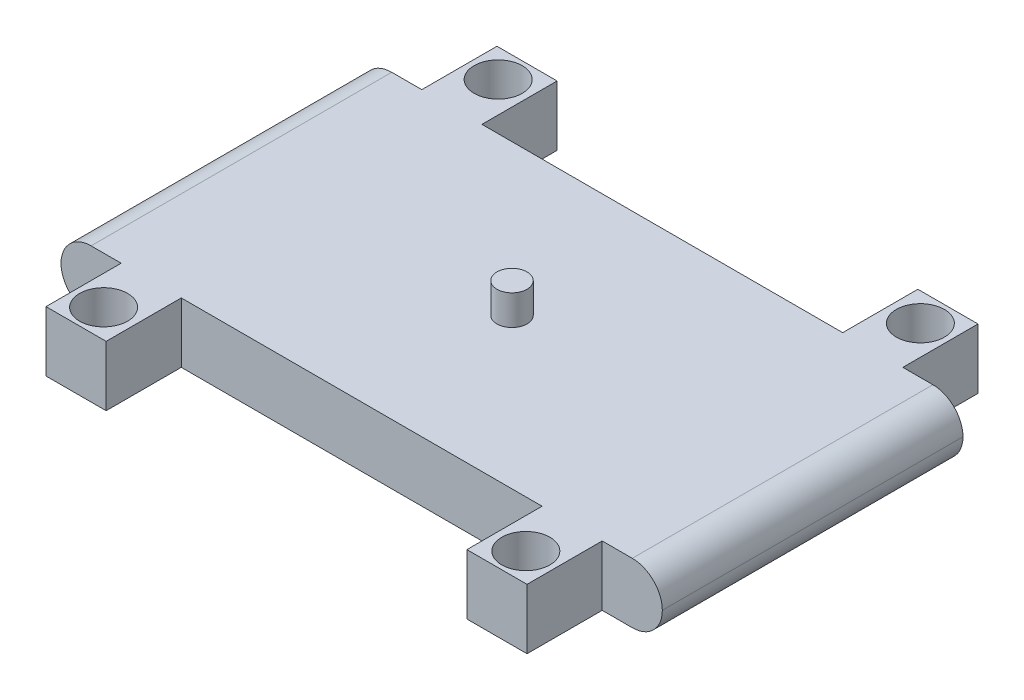
ISO-10303-21;
HEADER;
FILE_DESCRIPTION(('STEP AP214'),'2;1');
FILE_NAME('part.step','',(''),(''),'','','');
FILE_SCHEMA(('AUTOMOTIVE_DESIGN { 1 0 10303 214 1 1 1 1 }'));
ENDSEC;
DATA;
#1=APPLICATION_CONTEXT('core data for automotive mechanical design processes');
#2=APPLICATION_PROTOCOL_DEFINITION('international standard','automotive_design',2000,#1);
#3=PRODUCT_CONTEXT('',#1,'mechanical');
#4=PRODUCT('Part','Part','',(#3));
#5=PRODUCT_RELATED_PRODUCT_CATEGORY('part','',(#4));
#6=PRODUCT_DEFINITION_FORMATION('','',#4);
#7=PRODUCT_DEFINITION_CONTEXT('part definition',#1,'design');
#8=PRODUCT_DEFINITION('design','',#6,#7);
#9=PRODUCT_DEFINITION_SHAPE('','',#8);
#10=(LENGTH_UNIT() NAMED_UNIT(*) SI_UNIT(.MILLI.,.METRE.));
#11=(NAMED_UNIT(*) PLANE_ANGLE_UNIT() SI_UNIT($,.RADIAN.));
#12=(NAMED_UNIT(*) SI_UNIT($,.STERADIAN.) SOLID_ANGLE_UNIT());
#13=UNCERTAINTY_MEASURE_WITH_UNIT(LENGTH_MEASURE(1.E-05),#10,'distance_accuracy_value','');
#14=(GEOMETRIC_REPRESENTATION_CONTEXT(3) GLOBAL_UNCERTAINTY_ASSIGNED_CONTEXT((#13)) GLOBAL_UNIT_ASSIGNED_CONTEXT((#10,
#11,#12)) REPRESENTATION_CONTEXT('',''));
#15=CARTESIAN_POINT('',(0.,0.,0.));
#16=DIRECTION('',(0.,0.,1.));
#17=DIRECTION('',(1.,0.,0.));
#18=AXIS2_PLACEMENT_3D('',#15,#16,#17);
#19=CARTESIAN_POINT('',(100.,20.,50.));
#20=DIRECTION('',(0.,0.,-1.));
#21=DIRECTION('',(-1.,0.,0.));
#22=AXIS2_PLACEMENT_3D('',#19,#20,#21);
#23=PLANE('',#22);
#24=DIRECTION('',(1.,0.,0.));
#25=VECTOR('',#24,1.);
#26=CARTESIAN_POINT('',(100.,0.,50.));
#27=LINE('',#26,#25);
#28=CARTESIAN_POINT('',(80.,0.,50.));
#29=VERTEX_POINT('',#28);
#30=CARTESIAN_POINT('',(90.,0.,50.));
#31=VERTEX_POINT('',#30);
#32=EDGE_CURVE('E305',#29,#31,#27,.T.);
#33=ORIENTED_EDGE('',*,*,#32,.T.);
#34=CARTESIAN_POINT('',(90.,10.,50.));
#35=DIRECTION('',(0.,0.,-1.));
#36=DIRECTION('',(-1.,0.,0.));
#37=AXIS2_PLACEMENT_3D('',#34,#35,#36);
#38=CIRCLE('',#37,10.);
#39=CARTESIAN_POINT('',(100.,10.,50.));
#40=VERTEX_POINT('',#39);
#41=EDGE_CURVE('E338',#31,#40,#38,.F.);
#42=ORIENTED_EDGE('',*,*,#41,.T.);
#43=CARTESIAN_POINT('',(90.,10.,50.));
#44=DIRECTION('',(0.,0.,-1.));
#45=DIRECTION('',(-1.,0.,0.));
#46=AXIS2_PLACEMENT_3D('',#43,#44,#45);
#47=CIRCLE('',#46,10.);
#48=CARTESIAN_POINT('',(90.,20.,50.));
#49=VERTEX_POINT('',#48);
#50=EDGE_CURVE('E335',#40,#49,#47,.F.);
#51=ORIENTED_EDGE('',*,*,#50,.T.);
#52=DIRECTION('',(1.,0.,0.));
#53=VECTOR('',#52,1.);
#54=CARTESIAN_POINT('',(100.,20.,50.));
#55=LINE('',#54,#53);
#56=CARTESIAN_POINT('',(80.,20.,50.));
#57=VERTEX_POINT('',#56);
#58=EDGE_CURVE('E311',#57,#49,#55,.T.);
#59=ORIENTED_EDGE('',*,*,#58,.F.);
#60=DIRECTION('',(0.,1.,0.));
#61=VECTOR('',#60,1.);
#62=CARTESIAN_POINT('',(80.,20.,50.));
#63=LINE('',#62,#61);
#64=EDGE_CURVE('E218',#29,#57,#63,.T.);
#65=ORIENTED_EDGE('',*,*,#64,.F.);
#66=EDGE_LOOP('',(#33,#42,#51,#59,#65));
#67=FACE_BOUND('',#66,.T.);
#68=ADVANCED_FACE('F43',(#67),#23,.F.);
#69=DIRECTION('',(0.,-1.,0.));
#70=VECTOR('',#69,1.);
#71=CARTESIAN_POINT('',(60.,20.,50.));
#72=LINE('',#71,#70);
#73=CARTESIAN_POINT('',(60.,20.,50.));
#74=VERTEX_POINT('',#73);
#75=CARTESIAN_POINT('',(60.,0.,50.));
#76=VERTEX_POINT('',#75);
#77=EDGE_CURVE('E226',#74,#76,#72,.T.);
#78=ORIENTED_EDGE('',*,*,#77,.F.);
#79=CARTESIAN_POINT('',(-60.,20.,50.));
#80=VERTEX_POINT('',#79);
#81=EDGE_CURVE('E310',#80,#74,#55,.T.);
#82=ORIENTED_EDGE('',*,*,#81,.F.);
#83=DIRECTION('',(0.,1.,0.));
#84=VECTOR('',#83,1.);
#85=CARTESIAN_POINT('',(-60.,20.,50.));
#86=LINE('',#85,#84);
#87=CARTESIAN_POINT('',(-60.,0.,50.));
#88=VERTEX_POINT('',#87);
#89=EDGE_CURVE('E293',#88,#80,#86,.T.);
#90=ORIENTED_EDGE('',*,*,#89,.F.);
#91=EDGE_CURVE('E321',#88,#76,#27,.T.);
#92=ORIENTED_EDGE('',*,*,#91,.T.);
#93=EDGE_LOOP('',(#78,#82,#90,#92));
#94=FACE_BOUND('',#93,.T.);
#95=ADVANCED_FACE('F513',(#94),#23,.F.);
#96=CARTESIAN_POINT('',(100.,20.,-50.));
#97=DIRECTION('',(0.,0.,1.));
#98=DIRECTION('',(1.,0.,0.));
#99=AXIS2_PLACEMENT_3D('',#96,#97,#98);
#100=PLANE('',#99);
#101=CARTESIAN_POINT('',(90.,10.,-50.));
#102=DIRECTION('',(0.,0.,1.));
#103=DIRECTION('',(1.,0.,0.));
#104=AXIS2_PLACEMENT_3D('',#101,#102,#103);
#105=CIRCLE('',#104,10.);
#106=CARTESIAN_POINT('',(90.,20.,-50.));
#107=VERTEX_POINT('',#106);
#108=CARTESIAN_POINT('',(100.,10.,-50.));
#109=VERTEX_POINT('',#108);
#110=EDGE_CURVE('E315',#107,#109,#105,.F.);
#111=ORIENTED_EDGE('',*,*,#110,.T.);
#112=CARTESIAN_POINT('',(90.,10.,-50.));
#113=DIRECTION('',(0.,0.,1.));
#114=DIRECTION('',(1.,0.,0.));
#115=AXIS2_PLACEMENT_3D('',#112,#113,#114);
#116=CIRCLE('',#115,10.);
#117=CARTESIAN_POINT('',(90.,0.,-50.));
#118=VERTEX_POINT('',#117);
#119=EDGE_CURVE('E328',#109,#118,#116,.F.);
#120=ORIENTED_EDGE('',*,*,#119,.T.);
#121=DIRECTION('',(-1.,0.,0.));
#122=VECTOR('',#121,1.);
#123=CARTESIAN_POINT('',(100.,0.,-50.));
#124=LINE('',#123,#122);
#125=CARTESIAN_POINT('',(80.,0.,-50.));
#126=VERTEX_POINT('',#125);
#127=EDGE_CURVE('E322',#118,#126,#124,.T.);
#128=ORIENTED_EDGE('',*,*,#127,.T.);
#129=DIRECTION('',(0.,-1.,0.));
#130=VECTOR('',#129,1.);
#131=CARTESIAN_POINT('',(80.,20.,-50.));
#132=LINE('',#131,#130);
#133=CARTESIAN_POINT('',(80.,20.,-50.));
#134=VERTEX_POINT('',#133);
#135=EDGE_CURVE('E234',#134,#126,#132,.T.);
#136=ORIENTED_EDGE('',*,*,#135,.F.);
#137=DIRECTION('',(-1.,0.,0.));
#138=VECTOR('',#137,1.);
#139=CARTESIAN_POINT('',(100.,20.,-50.));
#140=LINE('',#139,#138);
#141=EDGE_CURVE('E312',#107,#134,#140,.T.);
#142=ORIENTED_EDGE('',*,*,#141,.F.);
#143=EDGE_LOOP('',(#111,#120,#128,#136,#142));
#144=FACE_BOUND('',#143,.T.);
#145=ADVANCED_FACE('F519',(#144),#100,.F.);
#146=DIRECTION('',(0.,1.,0.));
#147=VECTOR('',#146,1.);
#148=CARTESIAN_POINT('',(60.,20.,-50.));
#149=LINE('',#148,#147);
#150=CARTESIAN_POINT('',(60.,0.,-50.));
#151=VERTEX_POINT('',#150);
#152=CARTESIAN_POINT('',(60.,20.,-50.));
#153=VERTEX_POINT('',#152);
#154=EDGE_CURVE('E220',#151,#153,#149,.T.);
#155=ORIENTED_EDGE('',*,*,#154,.F.);
#156=CARTESIAN_POINT('',(-60.,0.,-50.));
#157=VERTEX_POINT('',#156);
#158=EDGE_CURVE('E325',#151,#157,#124,.T.);
#159=ORIENTED_EDGE('',*,*,#158,.T.);
#160=DIRECTION('',(0.,-1.,0.));
#161=VECTOR('',#160,1.);
#162=CARTESIAN_POINT('',(-60.,20.,-50.));
#163=LINE('',#162,#161);
#164=CARTESIAN_POINT('',(-60.,20.,-50.));
#165=VERTEX_POINT('',#164);
#166=EDGE_CURVE('E289',#165,#157,#163,.T.);
#167=ORIENTED_EDGE('',*,*,#166,.F.);
#168=EDGE_CURVE('E316',#153,#165,#140,.T.);
#169=ORIENTED_EDGE('',*,*,#168,.F.);
#170=EDGE_LOOP('',(#155,#159,#167,#169));
#171=FACE_BOUND('',#170,.T.);
#172=ADVANCED_FACE('F524',(#171),#100,.F.);
#173=CARTESIAN_POINT('',(-90.,10.,50.));
#174=DIRECTION('',(0.,0.,-1.));
#175=DIRECTION('',(-1.,0.,0.));
#176=AXIS2_PLACEMENT_3D('',#173,#174,#175);
#177=CIRCLE('',#176,10.);
#178=CARTESIAN_POINT('',(-90.,20.,50.));
#179=VERTEX_POINT('',#178);
#180=CARTESIAN_POINT('',(-100.,10.,50.));
#181=VERTEX_POINT('',#180);
#182=EDGE_CURVE('E344',#179,#181,#177,.F.);
#183=ORIENTED_EDGE('',*,*,#182,.T.);
#184=CARTESIAN_POINT('',(-90.,10.,50.));
#185=DIRECTION('',(0.,0.,-1.));
#186=DIRECTION('',(-1.,0.,0.));
#187=AXIS2_PLACEMENT_3D('',#184,#185,#186);
#188=CIRCLE('',#187,10.);
#189=CARTESIAN_POINT('',(-90.,0.,50.));
#190=VERTEX_POINT('',#189);
#191=EDGE_CURVE('E352',#181,#190,#188,.F.);
#192=ORIENTED_EDGE('',*,*,#191,.T.);
#193=CARTESIAN_POINT('',(-80.,0.,50.));
#194=VERTEX_POINT('',#193);
#195=EDGE_CURVE('E317',#190,#194,#27,.T.);
#196=ORIENTED_EDGE('',*,*,#195,.T.);
#197=DIRECTION('',(0.,-1.,0.));
#198=VECTOR('',#197,1.);
#199=CARTESIAN_POINT('',(-80.,20.,50.));
#200=LINE('',#199,#198);
#201=CARTESIAN_POINT('',(-80.,20.,50.));
#202=VERTEX_POINT('',#201);
#203=EDGE_CURVE('E301',#202,#194,#200,.T.);
#204=ORIENTED_EDGE('',*,*,#203,.F.);
#205=EDGE_CURVE('E306',#179,#202,#55,.T.);
#206=ORIENTED_EDGE('',*,*,#205,.F.);
#207=EDGE_LOOP('',(#183,#192,#196,#204,#206));
#208=FACE_BOUND('',#207,.T.);
#209=ADVANCED_FACE('F399',(#208),#23,.F.);
#210=CARTESIAN_POINT('',(-80.,0.,-50.));
#211=VERTEX_POINT('',#210);
#212=CARTESIAN_POINT('',(-90.,0.,-50.));
#213=VERTEX_POINT('',#212);
#214=EDGE_CURVE('E320',#211,#213,#124,.T.);
#215=ORIENTED_EDGE('',*,*,#214,.T.);
#216=CARTESIAN_POINT('',(-90.,10.,-50.));
#217=DIRECTION('',(0.,0.,1.));
#218=DIRECTION('',(1.,0.,0.));
#219=AXIS2_PLACEMENT_3D('',#216,#217,#218);
#220=CIRCLE('',#219,10.);
#221=CARTESIAN_POINT('',(-100.,10.,-50.));
#222=VERTEX_POINT('',#221);
#223=EDGE_CURVE('E53',#213,#222,#220,.F.);
#224=ORIENTED_EDGE('',*,*,#223,.T.);
#225=CARTESIAN_POINT('',(-90.,10.,-50.));
#226=DIRECTION('',(0.,0.,1.));
#227=DIRECTION('',(1.,0.,0.));
#228=AXIS2_PLACEMENT_3D('',#225,#226,#227);
#229=CIRCLE('',#228,10.);
#230=CARTESIAN_POINT('',(-90.,20.,-50.));
#231=VERTEX_POINT('',#230);
#232=EDGE_CURVE('E60',#222,#231,#229,.F.);
#233=ORIENTED_EDGE('',*,*,#232,.T.);
#234=CARTESIAN_POINT('',(-80.,20.,-50.));
#235=VERTEX_POINT('',#234);
#236=EDGE_CURVE('E309',#235,#231,#140,.T.);
#237=ORIENTED_EDGE('',*,*,#236,.F.);
#238=DIRECTION('',(0.,1.,0.));
#239=VECTOR('',#238,1.);
#240=CARTESIAN_POINT('',(-80.,20.,-50.));
#241=LINE('',#240,#239);
#242=EDGE_CURVE('E297',#211,#235,#241,.T.);
#243=ORIENTED_EDGE('',*,*,#242,.F.);
#244=EDGE_LOOP('',(#215,#224,#233,#237,#243));
#245=FACE_BOUND('',#244,.T.);
#246=ADVANCED_FACE('F523',(#245),#100,.F.);
#247=CARTESIAN_POINT('',(0.,20.,0.));
#248=DIRECTION('',(0.,1.,0.));
#249=DIRECTION('',(0.,0.,1.));
#250=AXIS2_PLACEMENT_3D('',#247,#248,#249);
#251=PLANE('',#250);
#252=CARTESIAN_POINT('',(0.,20.,0.));
#253=DIRECTION('',(0.,1.,0.));
#254=DIRECTION('',(0.,0.,1.));
#255=AXIS2_PLACEMENT_3D('',#252,#253,#254);
#256=CIRCLE('',#255,5.);
#257=CARTESIAN_POINT('',(0.,20.,5.));
#258=VERTEX_POINT('',#257);
#259=EDGE_CURVE('E486',#258,#258,#256,.F.);
#260=ORIENTED_EDGE('',*,*,#259,.T.);
#261=EDGE_LOOP('',(#260));
#262=FACE_BOUND('',#261,.T.);
#263=CARTESIAN_POINT('',(70.2217273274367,20.,-65.6166647925016));
#264=DIRECTION('',(0.,1.,0.));
#265=DIRECTION('',(0.,0.,1.));
#266=AXIS2_PLACEMENT_3D('',#263,#264,#265);
#267=CIRCLE('',#266,8.00000000000001);
#268=CARTESIAN_POINT('',(70.2217273274367,20.,-57.6166647925016));
#269=VERTEX_POINT('',#268);
#270=EDGE_CURVE('E450',#269,#269,#267,.F.);
#271=ORIENTED_EDGE('',*,*,#270,.T.);
#272=EDGE_LOOP('',(#271));
#273=FACE_BOUND('',#272,.T.);
#274=CARTESIAN_POINT('',(-70.2217273274367,20.,65.6166647925016));
#275=DIRECTION('',(0.,1.,0.));
#276=DIRECTION('',(0.,0.,1.));
#277=AXIS2_PLACEMENT_3D('',#274,#275,#276);
#278=CIRCLE('',#277,8.);
#279=CARTESIAN_POINT('',(-70.2217273274367,20.,73.6166647925016));
#280=VERTEX_POINT('',#279);
#281=EDGE_CURVE('E458',#280,#280,#278,.F.);
#282=ORIENTED_EDGE('',*,*,#281,.T.);
#283=EDGE_LOOP('',(#282));
#284=FACE_BOUND('',#283,.T.);
#285=CARTESIAN_POINT('',(70.2217273274367,20.,65.6166647925016));
#286=DIRECTION('',(0.,1.,0.));
#287=DIRECTION('',(0.,0.,1.));
#288=AXIS2_PLACEMENT_3D('',#285,#286,#287);
#289=CIRCLE('',#288,8.00000000000001);
#290=CARTESIAN_POINT('',(70.2217273274367,20.,73.6166647925016));
#291=VERTEX_POINT('',#290);
#292=EDGE_CURVE('E462',#291,#291,#289,.F.);
#293=ORIENTED_EDGE('',*,*,#292,.T.);
#294=EDGE_LOOP('',(#293));
#295=FACE_BOUND('',#294,.T.);
#296=CARTESIAN_POINT('',(-70.2217273274367,20.,-65.6166647925016));
#297=DIRECTION('',(0.,1.,0.));
#298=DIRECTION('',(0.,0.,1.));
#299=AXIS2_PLACEMENT_3D('',#296,#297,#298);
#300=CIRCLE('',#299,8.);
#301=CARTESIAN_POINT('',(-70.2217273274367,20.,-57.6166647925016));
#302=VERTEX_POINT('',#301);
#303=EDGE_CURVE('E466',#302,#302,#300,.F.);
#304=ORIENTED_EDGE('',*,*,#303,.T.);
#305=EDGE_LOOP('',(#304));
#306=FACE_BOUND('',#305,.T.);
#307=ORIENTED_EDGE('',*,*,#236,.T.);
#308=DIRECTION('',(0.,0.,1.));
#309=VECTOR('',#308,1.);
#310=CARTESIAN_POINT('',(-90.,20.,50.));
#311=LINE('',#310,#309);
#312=EDGE_CURVE('E11',#231,#179,#311,.T.);
#313=ORIENTED_EDGE('',*,*,#312,.T.);
#314=ORIENTED_EDGE('',*,*,#205,.T.);
#315=DIRECTION('',(0.,0.,-1.));
#316=VECTOR('',#315,1.);
#317=CARTESIAN_POINT('',(-80.,20.,75.));
#318=LINE('',#317,#316);
#319=CARTESIAN_POINT('',(-80.,20.,75.));
#320=VERTEX_POINT('',#319);
#321=EDGE_CURVE('E285',#320,#202,#318,.T.);
#322=ORIENTED_EDGE('',*,*,#321,.F.);
#323=DIRECTION('',(-1.,0.,0.));
#324=VECTOR('',#323,1.);
#325=CARTESIAN_POINT('',(-60.,20.,75.));
#326=LINE('',#325,#324);
#327=CARTESIAN_POINT('',(-60.,20.,75.));
#328=VERTEX_POINT('',#327);
#329=EDGE_CURVE('E241',#328,#320,#326,.T.);
#330=ORIENTED_EDGE('',*,*,#329,.F.);
#331=DIRECTION('',(0.,0.,-1.));
#332=VECTOR('',#331,1.);
#333=CARTESIAN_POINT('',(-60.,20.,75.));
#334=LINE('',#333,#332);
#335=EDGE_CURVE('E270',#328,#80,#334,.T.);
#336=ORIENTED_EDGE('',*,*,#335,.T.);
#337=ORIENTED_EDGE('',*,*,#81,.T.);
#338=DIRECTION('',(0.,0.,-1.));
#339=VECTOR('',#338,1.);
#340=CARTESIAN_POINT('',(60.,20.,75.));
#341=LINE('',#340,#339);
#342=CARTESIAN_POINT('',(60.,20.,75.));
#343=VERTEX_POINT('',#342);
#344=EDGE_CURVE('E198',#343,#74,#341,.T.);
#345=ORIENTED_EDGE('',*,*,#344,.F.);
#346=DIRECTION('',(-1.,0.,0.));
#347=VECTOR('',#346,1.);
#348=CARTESIAN_POINT('',(80.,20.,75.));
#349=LINE('',#348,#347);
#350=CARTESIAN_POINT('',(80.,20.,75.));
#351=VERTEX_POINT('',#350);
#352=EDGE_CURVE('E190',#351,#343,#349,.T.);
#353=ORIENTED_EDGE('',*,*,#352,.F.);
#354=DIRECTION('',(0.,0.,-1.));
#355=VECTOR('',#354,1.);
#356=CARTESIAN_POINT('',(80.,20.,75.));
#357=LINE('',#356,#355);
#358=EDGE_CURVE('E195',#351,#57,#357,.T.);
#359=ORIENTED_EDGE('',*,*,#358,.T.);
#360=ORIENTED_EDGE('',*,*,#58,.T.);
#361=DIRECTION('',(0.,0.,-1.));
#362=VECTOR('',#361,1.);
#363=CARTESIAN_POINT('',(90.,20.,-50.));
#364=LINE('',#363,#362);
#365=EDGE_CURVE('E341',#49,#107,#364,.T.);
#366=ORIENTED_EDGE('',*,*,#365,.T.);
#367=ORIENTED_EDGE('',*,*,#141,.T.);
#368=CARTESIAN_POINT('',(80.,20.,-75.));
#369=VERTEX_POINT('',#368);
#370=EDGE_CURVE('E221',#134,#369,#357,.T.);
#371=ORIENTED_EDGE('',*,*,#370,.T.);
#372=DIRECTION('',(-1.,0.,0.));
#373=VECTOR('',#372,1.);
#374=CARTESIAN_POINT('',(80.,20.,-75.));
#375=LINE('',#374,#373);
#376=CARTESIAN_POINT('',(60.,20.,-75.));
#377=VERTEX_POINT('',#376);
#378=EDGE_CURVE('E443',#369,#377,#375,.T.);
#379=ORIENTED_EDGE('',*,*,#378,.T.);
#380=EDGE_CURVE('E421',#153,#377,#341,.T.);
#381=ORIENTED_EDGE('',*,*,#380,.F.);
#382=ORIENTED_EDGE('',*,*,#168,.T.);
#383=CARTESIAN_POINT('',(-60.,20.,-75.));
#384=VERTEX_POINT('',#383);
#385=EDGE_CURVE('E255',#165,#384,#334,.T.);
#386=ORIENTED_EDGE('',*,*,#385,.T.);
#387=DIRECTION('',(-1.,0.,0.));
#388=VECTOR('',#387,1.);
#389=CARTESIAN_POINT('',(-60.,20.,-75.));
#390=LINE('',#389,#388);
#391=CARTESIAN_POINT('',(-80.,20.,-75.));
#392=VERTEX_POINT('',#391);
#393=EDGE_CURVE('E240',#384,#392,#390,.T.);
#394=ORIENTED_EDGE('',*,*,#393,.T.);
#395=EDGE_CURVE('E284',#235,#392,#318,.T.);
#396=ORIENTED_EDGE('',*,*,#395,.F.);
#397=EDGE_LOOP('',(#307,#313,#314,#322,#330,#336,#337,#345,#353,#359,#360,#366,#367,#371,#379,
#381,#382,#386,#394,#396));
#398=FACE_BOUND('',#397,.T.);
#399=ADVANCED_FACE('F192',(#262,#273,#284,#295,#306,#398),#251,.T.);
#400=CARTESIAN_POINT('',(0.,0.,0.));
#401=DIRECTION('',(0.,1.,0.));
#402=DIRECTION('',(0.,0.,1.));
#403=AXIS2_PLACEMENT_3D('',#400,#401,#402);
#404=PLANE('',#403);
#405=CARTESIAN_POINT('',(70.2217273274367,0.,-65.6166647925016));
#406=DIRECTION('',(0.,1.,0.));
#407=DIRECTION('',(0.,0.,1.));
#408=AXIS2_PLACEMENT_3D('',#405,#406,#407);
#409=CIRCLE('',#408,8.00000000000001);
#410=CARTESIAN_POINT('',(70.2217273274367,0.,-57.6166647925016));
#411=VERTEX_POINT('',#410);
#412=EDGE_CURVE('E474',#411,#411,#409,.T.);
#413=ORIENTED_EDGE('',*,*,#412,.T.);
#414=EDGE_LOOP('',(#413));
#415=FACE_BOUND('',#414,.T.);
#416=CARTESIAN_POINT('',(-70.2217273274367,0.,65.6166647925016));
#417=DIRECTION('',(0.,1.,0.));
#418=DIRECTION('',(0.,0.,1.));
#419=AXIS2_PLACEMENT_3D('',#416,#417,#418);
#420=CIRCLE('',#419,8.);
#421=CARTESIAN_POINT('',(-70.2217273274367,0.,73.6166647925016));
#422=VERTEX_POINT('',#421);
#423=EDGE_CURVE('E475',#422,#422,#420,.T.);
#424=ORIENTED_EDGE('',*,*,#423,.T.);
#425=EDGE_LOOP('',(#424));
#426=FACE_BOUND('',#425,.T.);
#427=CARTESIAN_POINT('',(70.2217273274367,0.,65.6166647925016));
#428=DIRECTION('',(0.,1.,0.));
#429=DIRECTION('',(0.,0.,1.));
#430=AXIS2_PLACEMENT_3D('',#427,#428,#429);
#431=CIRCLE('',#430,8.00000000000001);
#432=CARTESIAN_POINT('',(70.2217273274367,0.,73.6166647925016));
#433=VERTEX_POINT('',#432);
#434=EDGE_CURVE('E479',#433,#433,#431,.T.);
#435=ORIENTED_EDGE('',*,*,#434,.T.);
#436=EDGE_LOOP('',(#435));
#437=FACE_BOUND('',#436,.T.);
#438=CARTESIAN_POINT('',(-70.2217273274367,0.,-65.6166647925016));
#439=DIRECTION('',(0.,1.,0.));
#440=DIRECTION('',(0.,0.,1.));
#441=AXIS2_PLACEMENT_3D('',#438,#439,#440);
#442=CIRCLE('',#441,8.);
#443=CARTESIAN_POINT('',(-70.2217273274367,0.,-57.6166647925016));
#444=VERTEX_POINT('',#443);
#445=EDGE_CURVE('E470',#444,#444,#442,.T.);
#446=ORIENTED_EDGE('',*,*,#445,.T.);
#447=EDGE_LOOP('',(#446));
#448=FACE_BOUND('',#447,.T.);
#449=ORIENTED_EDGE('',*,*,#195,.F.);
#450=DIRECTION('',(0.,0.,1.));
#451=VECTOR('',#450,1.);
#452=CARTESIAN_POINT('',(-90.,0.,0.));
#453=LINE('',#452,#451);
#454=EDGE_CURVE('E355',#190,#213,#453,.F.);
#455=ORIENTED_EDGE('',*,*,#454,.T.);
#456=ORIENTED_EDGE('',*,*,#214,.F.);
#457=DIRECTION('',(0.,0.,-1.));
#458=VECTOR('',#457,1.);
#459=CARTESIAN_POINT('',(-80.,0.,75.));
#460=LINE('',#459,#458);
#461=CARTESIAN_POINT('',(-80.,0.,-75.));
#462=VERTEX_POINT('',#461);
#463=EDGE_CURVE('E279',#211,#462,#460,.T.);
#464=ORIENTED_EDGE('',*,*,#463,.T.);
#465=DIRECTION('',(1.,0.,0.));
#466=VECTOR('',#465,1.);
#467=CARTESIAN_POINT('',(-80.,0.,-75.));
#468=LINE('',#467,#466);
#469=CARTESIAN_POINT('',(-60.,0.,-75.));
#470=VERTEX_POINT('',#469);
#471=EDGE_CURVE('E263',#462,#470,#468,.T.);
#472=ORIENTED_EDGE('',*,*,#471,.T.);
#473=DIRECTION('',(0.,0.,-1.));
#474=VECTOR('',#473,1.);
#475=CARTESIAN_POINT('',(-60.,0.,75.));
#476=LINE('',#475,#474);
#477=EDGE_CURVE('E274',#157,#470,#476,.T.);
#478=ORIENTED_EDGE('',*,*,#477,.F.);
#479=ORIENTED_EDGE('',*,*,#158,.F.);
#480=DIRECTION('',(0.,0.,-1.));
#481=VECTOR('',#480,1.);
#482=CARTESIAN_POINT('',(60.,0.,75.));
#483=LINE('',#482,#481);
#484=CARTESIAN_POINT('',(60.,0.,-75.));
#485=VERTEX_POINT('',#484);
#486=EDGE_CURVE('E428',#151,#485,#483,.T.);
#487=ORIENTED_EDGE('',*,*,#486,.T.);
#488=DIRECTION('',(1.,0.,0.));
#489=VECTOR('',#488,1.);
#490=CARTESIAN_POINT('',(80.,0.,-75.));
#491=LINE('',#490,#489);
#492=CARTESIAN_POINT('',(80.,0.,-75.));
#493=VERTEX_POINT('',#492);
#494=EDGE_CURVE('E213',#485,#493,#491,.T.);
#495=ORIENTED_EDGE('',*,*,#494,.T.);
#496=DIRECTION('',(0.,0.,-1.));
#497=VECTOR('',#496,1.);
#498=CARTESIAN_POINT('',(80.,0.,75.));
#499=LINE('',#498,#497);
#500=EDGE_CURVE('E436',#126,#493,#499,.T.);
#501=ORIENTED_EDGE('',*,*,#500,.F.);
#502=ORIENTED_EDGE('',*,*,#127,.F.);
#503=DIRECTION('',(0.,0.,-1.));
#504=VECTOR('',#503,1.);
#505=CARTESIAN_POINT('',(90.,0.,0.));
#506=LINE('',#505,#504);
#507=EDGE_CURVE('E331',#118,#31,#506,.F.);
#508=ORIENTED_EDGE('',*,*,#507,.T.);
#509=ORIENTED_EDGE('',*,*,#32,.F.);
#510=CARTESIAN_POINT('',(80.,0.,75.));
#511=VERTEX_POINT('',#510);
#512=EDGE_CURVE('E432',#511,#29,#499,.T.);
#513=ORIENTED_EDGE('',*,*,#512,.F.);
#514=DIRECTION('',(1.,0.,0.));
#515=VECTOR('',#514,1.);
#516=CARTESIAN_POINT('',(80.,0.,75.));
#517=LINE('',#516,#515);
#518=CARTESIAN_POINT('',(60.,0.,75.));
#519=VERTEX_POINT('',#518);
#520=EDGE_CURVE('E208',#519,#511,#517,.T.);
#521=ORIENTED_EDGE('',*,*,#520,.F.);
#522=EDGE_CURVE('E423',#519,#76,#483,.T.);
#523=ORIENTED_EDGE('',*,*,#522,.T.);
#524=ORIENTED_EDGE('',*,*,#91,.F.);
#525=CARTESIAN_POINT('',(-60.,0.,75.));
#526=VERTEX_POINT('',#525);
#527=EDGE_CURVE('E275',#526,#88,#476,.T.);
#528=ORIENTED_EDGE('',*,*,#527,.F.);
#529=DIRECTION('',(1.,0.,0.));
#530=VECTOR('',#529,1.);
#531=CARTESIAN_POINT('',(-80.,0.,75.));
#532=LINE('',#531,#530);
#533=CARTESIAN_POINT('',(-80.,0.,75.));
#534=VERTEX_POINT('',#533);
#535=EDGE_CURVE('E249',#534,#526,#532,.T.);
#536=ORIENTED_EDGE('',*,*,#535,.F.);
#537=EDGE_CURVE('E280',#534,#194,#460,.T.);
#538=ORIENTED_EDGE('',*,*,#537,.T.);
#539=EDGE_LOOP('',(#449,#455,#456,#464,#472,#478,#479,#487,#495,#501,#502,#508,#509,#513,#521,
#523,#524,#528,#536,#538));
#540=FACE_BOUND('',#539,.T.);
#541=ADVANCED_FACE('F536',(#415,#426,#437,#448,#540),#404,.F.);
#542=CARTESIAN_POINT('',(0.,0.,-75.));
#543=DIRECTION('',(0.,0.,1.));
#544=DIRECTION('',(1.,0.,0.));
#545=AXIS2_PLACEMENT_3D('',#542,#543,#544);
#546=PLANE('',#545);
#547=ORIENTED_EDGE('',*,*,#393,.F.);
#548=DIRECTION('',(0.,1.,0.));
#549=VECTOR('',#548,1.);
#550=CARTESIAN_POINT('',(-60.,0.,-75.));
#551=LINE('',#550,#549);
#552=EDGE_CURVE('E246',#470,#384,#551,.T.);
#553=ORIENTED_EDGE('',*,*,#552,.F.);
#554=ORIENTED_EDGE('',*,*,#471,.F.);
#555=DIRECTION('',(0.,-1.,0.));
#556=VECTOR('',#555,1.);
#557=CARTESIAN_POINT('',(-80.,20.,-75.));
#558=LINE('',#557,#556);
#559=EDGE_CURVE('E259',#392,#462,#558,.T.);
#560=ORIENTED_EDGE('',*,*,#559,.F.);
#561=EDGE_LOOP('',(#547,#553,#554,#560));
#562=FACE_BOUND('',#561,.T.);
#563=ADVANCED_FACE('F387',(#562),#546,.F.);
#564=CARTESIAN_POINT('',(-60.,0.,75.));
#565=DIRECTION('',(-1.,0.,0.));
#566=DIRECTION('',(0.,0.,1.));
#567=AXIS2_PLACEMENT_3D('',#564,#565,#566);
#568=PLANE('',#567);
#569=ORIENTED_EDGE('',*,*,#385,.F.);
#570=ORIENTED_EDGE('',*,*,#166,.T.);
#571=ORIENTED_EDGE('',*,*,#477,.T.);
#572=ORIENTED_EDGE('',*,*,#552,.T.);
#573=EDGE_LOOP('',(#569,#570,#571,#572));
#574=FACE_BOUND('',#573,.T.);
#575=ADVANCED_FACE('F382',(#574),#568,.F.);
#576=CARTESIAN_POINT('',(-80.,20.,75.));
#577=DIRECTION('',(1.,0.,0.));
#578=DIRECTION('',(0.,0.,-1.));
#579=AXIS2_PLACEMENT_3D('',#576,#577,#578);
#580=PLANE('',#579);
#581=ORIENTED_EDGE('',*,*,#463,.F.);
#582=ORIENTED_EDGE('',*,*,#242,.T.);
#583=ORIENTED_EDGE('',*,*,#395,.T.);
#584=ORIENTED_EDGE('',*,*,#559,.T.);
#585=EDGE_LOOP('',(#581,#582,#583,#584));
#586=FACE_BOUND('',#585,.T.);
#587=ADVANCED_FACE('F390',(#586),#580,.F.);
#588=ORIENTED_EDGE('',*,*,#321,.T.);
#589=ORIENTED_EDGE('',*,*,#203,.T.);
#590=ORIENTED_EDGE('',*,*,#537,.F.);
#591=DIRECTION('',(0.,-1.,0.));
#592=VECTOR('',#591,1.);
#593=CARTESIAN_POINT('',(-80.,20.,75.));
#594=LINE('',#593,#592);
#595=EDGE_CURVE('E245',#320,#534,#594,.T.);
#596=ORIENTED_EDGE('',*,*,#595,.F.);
#597=EDGE_LOOP('',(#588,#589,#590,#596));
#598=FACE_BOUND('',#597,.T.);
#599=ADVANCED_FACE('F405',(#598),#580,.F.);
#600=ORIENTED_EDGE('',*,*,#527,.T.);
#601=ORIENTED_EDGE('',*,*,#89,.T.);
#602=ORIENTED_EDGE('',*,*,#335,.F.);
#603=DIRECTION('',(0.,1.,0.));
#604=VECTOR('',#603,1.);
#605=CARTESIAN_POINT('',(-60.,0.,75.));
#606=LINE('',#605,#604);
#607=EDGE_CURVE('E252',#526,#328,#606,.T.);
#608=ORIENTED_EDGE('',*,*,#607,.F.);
#609=EDGE_LOOP('',(#600,#601,#602,#608));
#610=FACE_BOUND('',#609,.T.);
#611=ADVANCED_FACE('F414',(#610),#568,.F.);
#612=CARTESIAN_POINT('',(0.,0.,75.));
#613=DIRECTION('',(0.,0.,1.));
#614=DIRECTION('',(1.,0.,0.));
#615=AXIS2_PLACEMENT_3D('',#612,#613,#614);
#616=PLANE('',#615);
#617=ORIENTED_EDGE('',*,*,#329,.T.);
#618=ORIENTED_EDGE('',*,*,#595,.T.);
#619=ORIENTED_EDGE('',*,*,#535,.T.);
#620=ORIENTED_EDGE('',*,*,#607,.T.);
#621=EDGE_LOOP('',(#617,#618,#619,#620));
#622=FACE_BOUND('',#621,.T.);
#623=ADVANCED_FACE('F409',(#622),#616,.T.);
#624=CARTESIAN_POINT('',(0.,0.,-75.));
#625=DIRECTION('',(0.,0.,-1.));
#626=DIRECTION('',(-1.,0.,0.));
#627=AXIS2_PLACEMENT_3D('',#624,#625,#626);
#628=PLANE('',#627);
#629=DIRECTION('',(0.,1.,0.));
#630=VECTOR('',#629,1.);
#631=CARTESIAN_POINT('',(80.,20.,-75.));
#632=LINE('',#631,#630);
#633=EDGE_CURVE('E446',#493,#369,#632,.T.);
#634=ORIENTED_EDGE('',*,*,#633,.F.);
#635=ORIENTED_EDGE('',*,*,#494,.F.);
#636=DIRECTION('',(0.,-1.,0.));
#637=VECTOR('',#636,1.);
#638=CARTESIAN_POINT('',(60.,20.,-75.));
#639=LINE('',#638,#637);
#640=EDGE_CURVE('E440',#377,#485,#639,.T.);
#641=ORIENTED_EDGE('',*,*,#640,.F.);
#642=ORIENTED_EDGE('',*,*,#378,.F.);
#643=EDGE_LOOP('',(#634,#635,#641,#642));
#644=FACE_BOUND('',#643,.T.);
#645=ADVANCED_FACE('F551',(#644),#628,.T.);
#646=CARTESIAN_POINT('',(60.,20.,75.));
#647=DIRECTION('',(1.,0.,0.));
#648=DIRECTION('',(0.,0.,-1.));
#649=AXIS2_PLACEMENT_3D('',#646,#647,#648);
#650=PLANE('',#649);
#651=ORIENTED_EDGE('',*,*,#486,.F.);
#652=ORIENTED_EDGE('',*,*,#154,.T.);
#653=ORIENTED_EDGE('',*,*,#380,.T.);
#654=ORIENTED_EDGE('',*,*,#640,.T.);
#655=EDGE_LOOP('',(#651,#652,#653,#654));
#656=FACE_BOUND('',#655,.T.);
#657=ADVANCED_FACE('F557',(#656),#650,.F.);
#658=CARTESIAN_POINT('',(80.,20.,75.));
#659=DIRECTION('',(-1.,0.,0.));
#660=DIRECTION('',(0.,0.,1.));
#661=AXIS2_PLACEMENT_3D('',#658,#659,#660);
#662=PLANE('',#661);
#663=ORIENTED_EDGE('',*,*,#370,.F.);
#664=ORIENTED_EDGE('',*,*,#135,.T.);
#665=ORIENTED_EDGE('',*,*,#500,.T.);
#666=ORIENTED_EDGE('',*,*,#633,.T.);
#667=EDGE_LOOP('',(#663,#664,#665,#666));
#668=FACE_BOUND('',#667,.T.);
#669=ADVANCED_FACE('F554',(#668),#662,.F.);
#670=ORIENTED_EDGE('',*,*,#512,.T.);
#671=ORIENTED_EDGE('',*,*,#64,.T.);
#672=ORIENTED_EDGE('',*,*,#358,.F.);
#673=DIRECTION('',(0.,1.,0.));
#674=VECTOR('',#673,1.);
#675=CARTESIAN_POINT('',(80.,20.,75.));
#676=LINE('',#675,#674);
#677=EDGE_CURVE('E203',#511,#351,#676,.T.);
#678=ORIENTED_EDGE('',*,*,#677,.F.);
#679=EDGE_LOOP('',(#670,#671,#672,#678));
#680=FACE_BOUND('',#679,.T.);
#681=ADVANCED_FACE('F216',(#680),#662,.F.);
#682=ORIENTED_EDGE('',*,*,#344,.T.);
#683=ORIENTED_EDGE('',*,*,#77,.T.);
#684=ORIENTED_EDGE('',*,*,#522,.F.);
#685=DIRECTION('',(0.,-1.,0.));
#686=VECTOR('',#685,1.);
#687=CARTESIAN_POINT('',(60.,20.,75.));
#688=LINE('',#687,#686);
#689=EDGE_CURVE('E202',#343,#519,#688,.T.);
#690=ORIENTED_EDGE('',*,*,#689,.F.);
#691=EDGE_LOOP('',(#682,#683,#684,#690));
#692=FACE_BOUND('',#691,.T.);
#693=ADVANCED_FACE('F417',(#692),#650,.F.);
#694=CARTESIAN_POINT('',(0.,0.,75.));
#695=DIRECTION('',(0.,0.,-1.));
#696=DIRECTION('',(-1.,0.,0.));
#697=AXIS2_PLACEMENT_3D('',#694,#695,#696);
#698=PLANE('',#697);
#699=ORIENTED_EDGE('',*,*,#677,.T.);
#700=ORIENTED_EDGE('',*,*,#352,.T.);
#701=ORIENTED_EDGE('',*,*,#689,.T.);
#702=ORIENTED_EDGE('',*,*,#520,.T.);
#703=EDGE_LOOP('',(#699,#700,#701,#702));
#704=FACE_BOUND('',#703,.T.);
#705=ADVANCED_FACE('F206',(#704),#698,.F.);
#706=CARTESIAN_POINT('',(-70.2217273274367,150.,-65.6166647925016));
#707=DIRECTION('',(0.,-1.,0.));
#708=DIRECTION('',(0.,0.,-1.));
#709=AXIS2_PLACEMENT_3D('',#706,#707,#708);
#710=CYLINDRICAL_SURFACE('',#709,8.);
#711=ORIENTED_EDGE('',*,*,#303,.F.);
#712=EDGE_LOOP('',(#711));
#713=FACE_BOUND('',#712,.T.);
#714=ORIENTED_EDGE('',*,*,#445,.F.);
#715=EDGE_LOOP('',(#714));
#716=FACE_BOUND('',#715,.T.);
#717=ADVANCED_FACE('F563',(#713,#716),#710,.F.);
#718=CARTESIAN_POINT('',(70.2217273274367,150.,65.6166647925016));
#719=DIRECTION('',(0.,-1.,0.));
#720=DIRECTION('',(0.,0.,-1.));
#721=AXIS2_PLACEMENT_3D('',#718,#719,#720);
#722=CYLINDRICAL_SURFACE('',#721,8.00000000000001);
#723=ORIENTED_EDGE('',*,*,#292,.F.);
#724=EDGE_LOOP('',(#723));
#725=FACE_BOUND('',#724,.T.);
#726=ORIENTED_EDGE('',*,*,#434,.F.);
#727=EDGE_LOOP('',(#726));
#728=FACE_BOUND('',#727,.T.);
#729=ADVANCED_FACE('F566',(#725,#728),#722,.F.);
#730=CARTESIAN_POINT('',(-70.2217273274367,150.,65.6166647925016));
#731=DIRECTION('',(0.,-1.,0.));
#732=DIRECTION('',(0.,0.,-1.));
#733=AXIS2_PLACEMENT_3D('',#730,#731,#732);
#734=CYLINDRICAL_SURFACE('',#733,8.);
#735=ORIENTED_EDGE('',*,*,#281,.F.);
#736=EDGE_LOOP('',(#735));
#737=FACE_BOUND('',#736,.T.);
#738=ORIENTED_EDGE('',*,*,#423,.F.);
#739=EDGE_LOOP('',(#738));
#740=FACE_BOUND('',#739,.T.);
#741=ADVANCED_FACE('F507',(#737,#740),#734,.F.);
#742=CARTESIAN_POINT('',(70.2217273274367,150.,-65.6166647925016));
#743=DIRECTION('',(0.,-1.,0.));
#744=DIRECTION('',(0.,0.,-1.));
#745=AXIS2_PLACEMENT_3D('',#742,#743,#744);
#746=CYLINDRICAL_SURFACE('',#745,8.00000000000001);
#747=ORIENTED_EDGE('',*,*,#270,.F.);
#748=EDGE_LOOP('',(#747));
#749=FACE_BOUND('',#748,.T.);
#750=ORIENTED_EDGE('',*,*,#412,.F.);
#751=EDGE_LOOP('',(#750));
#752=FACE_BOUND('',#751,.T.);
#753=ADVANCED_FACE('F498',(#749,#752),#746,.F.);
#754=CARTESIAN_POINT('',(0.,30.,0.));
#755=DIRECTION('',(0.,-1.,0.));
#756=DIRECTION('',(0.,0.,-1.));
#757=AXIS2_PLACEMENT_3D('',#754,#755,#756);
#758=CYLINDRICAL_SURFACE('',#757,5.);
#759=ORIENTED_EDGE('',*,*,#259,.F.);
#760=EDGE_LOOP('',(#759));
#761=FACE_BOUND('',#760,.T.);
#762=CARTESIAN_POINT('',(0.,30.,0.));
#763=DIRECTION('',(0.,1.,0.));
#764=DIRECTION('',(0.,0.,1.));
#765=AXIS2_PLACEMENT_3D('',#762,#763,#764);
#766=CIRCLE('',#765,5.);
#767=CARTESIAN_POINT('',(0.,30.,5.));
#768=VERTEX_POINT('',#767);
#769=EDGE_CURVE('E349',#768,#768,#766,.T.);
#770=ORIENTED_EDGE('',*,*,#769,.F.);
#771=EDGE_LOOP('',(#770));
#772=FACE_BOUND('',#771,.T.);
#773=ADVANCED_FACE('F496',(#761,#772),#758,.T.);
#774=CARTESIAN_POINT('',(0.,30.,0.));
#775=DIRECTION('',(0.,1.,0.));
#776=DIRECTION('',(0.,0.,1.));
#777=AXIS2_PLACEMENT_3D('',#774,#775,#776);
#778=PLANE('',#777);
#779=ORIENTED_EDGE('',*,*,#769,.T.);
#780=EDGE_LOOP('',(#779));
#781=FACE_BOUND('',#780,.T.);
#782=ADVANCED_FACE('F494',(#781),#778,.T.);
#783=CARTESIAN_POINT('',(90.,10.,0.));
#784=DIRECTION('',(0.,0.,1.));
#785=DIRECTION('',(1.,0.,0.));
#786=AXIS2_PLACEMENT_3D('',#783,#784,#785);
#787=CYLINDRICAL_SURFACE('',#786,10.);
#788=ORIENTED_EDGE('',*,*,#365,.F.);
#789=ORIENTED_EDGE('',*,*,#50,.F.);
#790=DIRECTION('',(0.,0.,-1.));
#791=VECTOR('',#790,1.);
#792=CARTESIAN_POINT('',(100.,10.,50.));
#793=LINE('',#792,#791);
#794=EDGE_CURVE('E345',#109,#40,#793,.F.);
#795=ORIENTED_EDGE('',*,*,#794,.F.);
#796=ORIENTED_EDGE('',*,*,#110,.F.);
#797=EDGE_LOOP('',(#788,#789,#795,#796));
#798=FACE_BOUND('',#797,.T.);
#799=ADVANCED_FACE('F505',(#798),#787,.T.);
#800=CARTESIAN_POINT('',(90.,10.,50.));
#801=DIRECTION('',(0.,0.,-1.));
#802=DIRECTION('',(-1.,0.,0.));
#803=AXIS2_PLACEMENT_3D('',#800,#801,#802);
#804=CYLINDRICAL_SURFACE('',#803,10.);
#805=ORIENTED_EDGE('',*,*,#41,.F.);
#806=ORIENTED_EDGE('',*,*,#507,.F.);
#807=ORIENTED_EDGE('',*,*,#119,.F.);
#808=ORIENTED_EDGE('',*,*,#794,.T.);
#809=EDGE_LOOP('',(#805,#806,#807,#808));
#810=FACE_BOUND('',#809,.T.);
#811=ADVANCED_FACE('F589',(#810),#804,.T.);
#812=CARTESIAN_POINT('',(-90.,10.,0.));
#813=DIRECTION('',(0.,0.,-1.));
#814=DIRECTION('',(-1.,0.,0.));
#815=AXIS2_PLACEMENT_3D('',#812,#813,#814);
#816=CYLINDRICAL_SURFACE('',#815,10.);
#817=ORIENTED_EDGE('',*,*,#312,.F.);
#818=ORIENTED_EDGE('',*,*,#232,.F.);
#819=DIRECTION('',(0.,0.,1.));
#820=VECTOR('',#819,1.);
#821=CARTESIAN_POINT('',(-100.,10.,-50.));
#822=LINE('',#821,#820);
#823=EDGE_CURVE('E47',#181,#222,#822,.F.);
#824=ORIENTED_EDGE('',*,*,#823,.F.);
#825=ORIENTED_EDGE('',*,*,#182,.F.);
#826=EDGE_LOOP('',(#817,#818,#824,#825));
#827=FACE_BOUND('',#826,.T.);
#828=ADVANCED_FACE('F45',(#827),#816,.T.);
#829=CARTESIAN_POINT('',(-90.,10.,50.));
#830=DIRECTION('',(0.,0.,1.));
#831=DIRECTION('',(1.,0.,0.));
#832=AXIS2_PLACEMENT_3D('',#829,#830,#831);
#833=CYLINDRICAL_SURFACE('',#832,10.);
#834=ORIENTED_EDGE('',*,*,#223,.F.);
#835=ORIENTED_EDGE('',*,*,#454,.F.);
#836=ORIENTED_EDGE('',*,*,#191,.F.);
#837=ORIENTED_EDGE('',*,*,#823,.T.);
#838=EDGE_LOOP('',(#834,#835,#836,#837));
#839=FACE_BOUND('',#838,.T.);
#840=ADVANCED_FACE('F583',(#839),#833,.T.);
#841=CLOSED_SHELL('',(#68,#95,#145,#172,#209,#246,#399,#541,#563,#575,#587,#599,#611,#623,#645,
#657,#669,#681,#693,#705,#717,#729,#741,#753,#773,#782,#799,#811,#828,#840));
#842=MANIFOLD_SOLID_BREP('B2',#841);
#843=ADVANCED_BREP_SHAPE_REPRESENTATION('',(#18,#842),#14);
#844=SHAPE_DEFINITION_REPRESENTATION(#9,#843);
ENDSEC;
END-ISO-10303-21;
